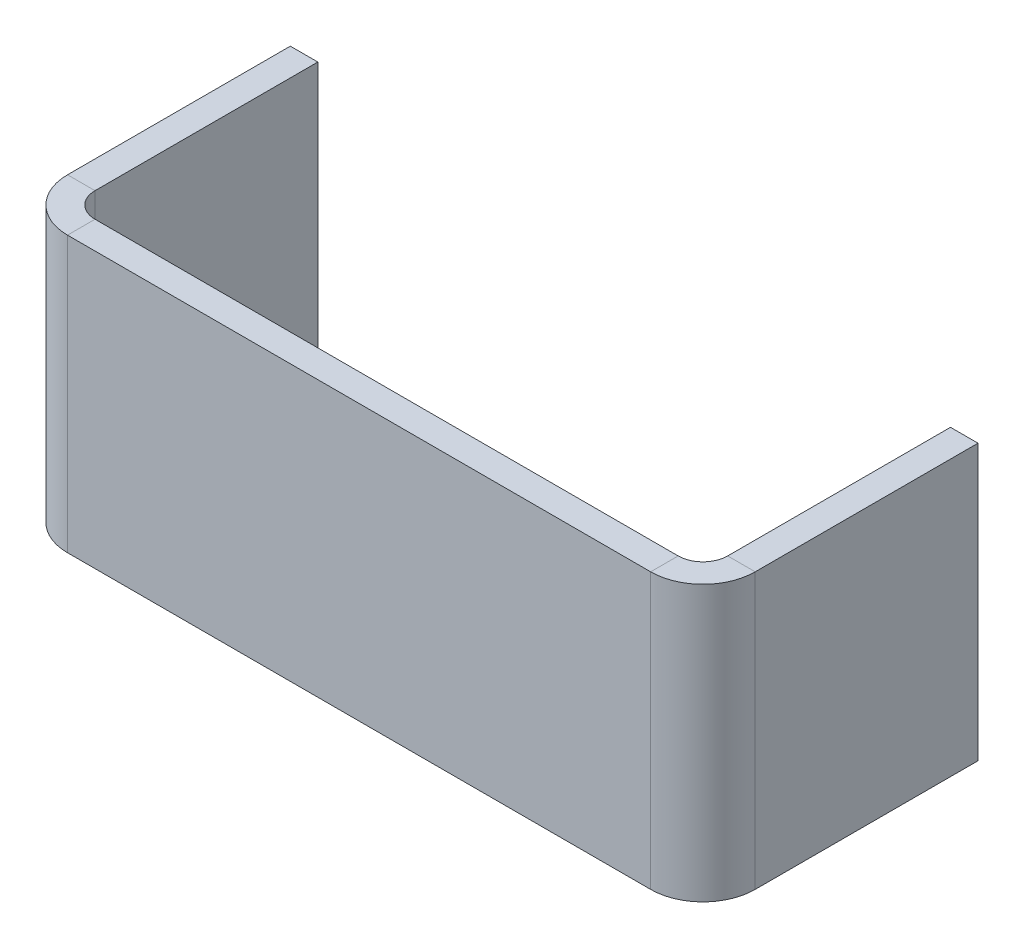
ISO-10303-21;
HEADER;
FILE_DESCRIPTION(('STEP AP214'),'2;1');
FILE_NAME('part.step','',(''),(''),'','','');
FILE_SCHEMA(('AUTOMOTIVE_DESIGN { 1 0 10303 214 1 1 1 1 }'));
ENDSEC;
DATA;
#1=APPLICATION_CONTEXT('core data for automotive mechanical design processes');
#2=APPLICATION_PROTOCOL_DEFINITION('international standard','automotive_design',2000,#1);
#3=PRODUCT_CONTEXT('',#1,'mechanical');
#4=PRODUCT('Part','Part','',(#3));
#5=PRODUCT_RELATED_PRODUCT_CATEGORY('part','',(#4));
#6=PRODUCT_DEFINITION_FORMATION('','',#4);
#7=PRODUCT_DEFINITION_CONTEXT('part definition',#1,'design');
#8=PRODUCT_DEFINITION('design','',#6,#7);
#9=PRODUCT_DEFINITION_SHAPE('','',#8);
#10=(LENGTH_UNIT() NAMED_UNIT(*) SI_UNIT(.MILLI.,.METRE.));
#11=(NAMED_UNIT(*) PLANE_ANGLE_UNIT() SI_UNIT($,.RADIAN.));
#12=(NAMED_UNIT(*) SI_UNIT($,.STERADIAN.) SOLID_ANGLE_UNIT());
#13=UNCERTAINTY_MEASURE_WITH_UNIT(LENGTH_MEASURE(1.E-05),#10,'distance_accuracy_value','');
#14=(GEOMETRIC_REPRESENTATION_CONTEXT(3) GLOBAL_UNCERTAINTY_ASSIGNED_CONTEXT((#13)) GLOBAL_UNIT_ASSIGNED_CONTEXT((#10,
#11,#12)) REPRESENTATION_CONTEXT('',''));
#15=CARTESIAN_POINT('',(0.,0.,0.));
#16=DIRECTION('',(0.,0.,1.));
#17=DIRECTION('',(1.,0.,0.));
#18=AXIS2_PLACEMENT_3D('',#15,#16,#17);
#19=CARTESIAN_POINT('',(0.,0.,-2.));
#20=DIRECTION('',(0.,0.,-1.));
#21=DIRECTION('',(-1.,0.,0.));
#22=AXIS2_PLACEMENT_3D('',#19,#20,#21);
#23=PLANE('',#22);
#24=DIRECTION('',(-1.,0.,0.));
#25=VECTOR('',#24,1.);
#26=CARTESIAN_POINT('',(-0.853018372703414,20.,-2.));
#27=LINE('',#26,#25);
#28=CARTESIAN_POINT('',(45.3469816272966,20.,-2.));
#29=VERTEX_POINT('',#28);
#30=CARTESIAN_POINT('',(2.94698162729658,20.,-2.));
#31=VERTEX_POINT('',#30);
#32=EDGE_CURVE('E13',#29,#31,#27,.T.);
#33=ORIENTED_EDGE('',*,*,#32,.F.);
#34=DIRECTION('',(0.,-1.,0.));
#35=VECTOR('',#34,1.);
#36=CARTESIAN_POINT('',(45.3469816272966,0.,-2.));
#37=LINE('',#36,#35);
#38=CARTESIAN_POINT('',(45.3469816272966,0.,-2.));
#39=VERTEX_POINT('',#38);
#40=EDGE_CURVE('E243',#39,#29,#37,.F.);
#41=ORIENTED_EDGE('',*,*,#40,.F.);
#42=DIRECTION('',(1.,0.,0.));
#43=VECTOR('',#42,1.);
#44=CARTESIAN_POINT('',(-0.853018372703415,0.,-2.));
#45=LINE('',#44,#43);
#46=CARTESIAN_POINT('',(2.94698162729658,0.,-2.));
#47=VERTEX_POINT('',#46);
#48=EDGE_CURVE('E90',#47,#39,#45,.T.);
#49=ORIENTED_EDGE('',*,*,#48,.F.);
#50=DIRECTION('',(0.,1.,0.));
#51=VECTOR('',#50,1.);
#52=CARTESIAN_POINT('',(2.94698162729658,20.,-2.));
#53=LINE('',#52,#51);
#54=EDGE_CURVE('E318',#31,#47,#53,.F.);
#55=ORIENTED_EDGE('',*,*,#54,.F.);
#56=EDGE_LOOP('',(#33,#41,#49,#55));
#57=FACE_BOUND('',#56,.T.);
#58=ADVANCED_FACE('F80',(#57),#23,.T.);
#59=CARTESIAN_POINT('',(0.,0.,0.));
#60=DIRECTION('',(0.,0.,-1.));
#61=DIRECTION('',(-1.,0.,0.));
#62=AXIS2_PLACEMENT_3D('',#59,#60,#61);
#63=PLANE('',#62);
#64=DIRECTION('',(0.,-1.,0.));
#65=VECTOR('',#64,1.);
#66=CARTESIAN_POINT('',(45.3469816272966,0.,0.));
#67=LINE('',#66,#65);
#68=CARTESIAN_POINT('',(45.3469816272966,0.,0.));
#69=VERTEX_POINT('',#68);
#70=CARTESIAN_POINT('',(45.3469816272966,20.,0.));
#71=VERTEX_POINT('',#70);
#72=EDGE_CURVE('E227',#69,#71,#67,.F.);
#73=ORIENTED_EDGE('',*,*,#72,.T.);
#74=DIRECTION('',(-1.,0.,0.));
#75=VECTOR('',#74,1.);
#76=CARTESIAN_POINT('',(-0.853018372703414,20.,0.));
#77=LINE('',#76,#75);
#78=CARTESIAN_POINT('',(2.94698162729658,20.,0.));
#79=VERTEX_POINT('',#78);
#80=EDGE_CURVE('E84',#71,#79,#77,.T.);
#81=ORIENTED_EDGE('',*,*,#80,.T.);
#82=DIRECTION('',(0.,1.,0.));
#83=VECTOR('',#82,1.);
#84=CARTESIAN_POINT('',(2.94698162729658,20.,0.));
#85=LINE('',#84,#83);
#86=CARTESIAN_POINT('',(2.94698162729658,0.,0.));
#87=VERTEX_POINT('',#86);
#88=EDGE_CURVE('E302',#79,#87,#85,.F.);
#89=ORIENTED_EDGE('',*,*,#88,.T.);
#90=DIRECTION('',(1.,0.,0.));
#91=VECTOR('',#90,1.);
#92=CARTESIAN_POINT('',(-0.853018372703415,0.,0.));
#93=LINE('',#92,#91);
#94=EDGE_CURVE('E327',#87,#69,#93,.T.);
#95=ORIENTED_EDGE('',*,*,#94,.T.);
#96=EDGE_LOOP('',(#73,#81,#89,#95));
#97=FACE_BOUND('',#96,.T.);
#98=ADVANCED_FACE('F337',(#97),#63,.F.);
#99=CARTESIAN_POINT('',(-0.853018372703415,0.,-2.));
#100=DIRECTION('',(0.,-1.,0.));
#101=DIRECTION('',(0.,0.,-1.));
#102=AXIS2_PLACEMENT_3D('',#99,#100,#101);
#103=PLANE('',#102);
#104=ORIENTED_EDGE('',*,*,#48,.T.);
#105=DIRECTION('',(0.,0.,1.));
#106=VECTOR('',#105,1.);
#107=CARTESIAN_POINT('',(45.3469816272966,0.,-2.));
#108=LINE('',#107,#106);
#109=EDGE_CURVE('E235',#39,#69,#108,.T.);
#110=ORIENTED_EDGE('',*,*,#109,.T.);
#111=ORIENTED_EDGE('',*,*,#94,.F.);
#112=DIRECTION('',(0.,0.,1.));
#113=VECTOR('',#112,1.);
#114=CARTESIAN_POINT('',(2.94698162729658,0.,-2.));
#115=LINE('',#114,#113);
#116=EDGE_CURVE('E98',#47,#87,#115,.T.);
#117=ORIENTED_EDGE('',*,*,#116,.F.);
#118=EDGE_LOOP('',(#104,#110,#111,#117));
#119=FACE_BOUND('',#118,.T.);
#120=ADVANCED_FACE('F82',(#119),#103,.T.);
#121=CARTESIAN_POINT('',(-0.853018372703414,20.,-2.));
#122=DIRECTION('',(0.,1.,0.));
#123=DIRECTION('',(0.,0.,1.));
#124=AXIS2_PLACEMENT_3D('',#121,#122,#123);
#125=PLANE('',#124);
#126=DIRECTION('',(0.,0.,1.));
#127=VECTOR('',#126,1.);
#128=CARTESIAN_POINT('',(45.3469816272966,20.,-2.));
#129=LINE('',#128,#127);
#130=EDGE_CURVE('E250',#29,#71,#129,.T.);
#131=ORIENTED_EDGE('',*,*,#130,.F.);
#132=ORIENTED_EDGE('',*,*,#32,.T.);
#133=DIRECTION('',(0.,0.,1.));
#134=VECTOR('',#133,1.);
#135=CARTESIAN_POINT('',(2.94698162729658,20.,-2.));
#136=LINE('',#135,#134);
#137=EDGE_CURVE('E310',#31,#79,#136,.T.);
#138=ORIENTED_EDGE('',*,*,#137,.T.);
#139=ORIENTED_EDGE('',*,*,#80,.F.);
#140=EDGE_LOOP('',(#131,#132,#138,#139));
#141=FACE_BOUND('',#140,.T.);
#142=ADVANCED_FACE('F389',(#141),#125,.T.);
#143=CARTESIAN_POINT('',(2.94698162729658,0.,-3.8));
#144=DIRECTION('',(0.,-1.,0.));
#145=DIRECTION('',(0.,0.,-1.));
#146=AXIS2_PLACEMENT_3D('',#143,#144,#145);
#147=PLANE('',#146);
#148=DIRECTION('',(-1.,0.,0.));
#149=VECTOR('',#148,1.);
#150=CARTESIAN_POINT('',(-0.853018372703423,0.,-3.79999999999999));
#151=LINE('',#150,#149);
#152=CARTESIAN_POINT('',(1.14698162729658,0.,-3.79999999999999));
#153=VERTEX_POINT('',#152);
#154=CARTESIAN_POINT('',(-0.853018372703421,0.,-3.79999999999999));
#155=VERTEX_POINT('',#154);
#156=EDGE_CURVE('E254',#153,#155,#151,.T.);
#157=ORIENTED_EDGE('',*,*,#156,.F.);
#158=CARTESIAN_POINT('',(2.94698162729658,0.,-3.8));
#159=DIRECTION('',(0.,1.,0.));
#160=DIRECTION('',(0.,0.,1.));
#161=AXIS2_PLACEMENT_3D('',#158,#159,#160);
#162=CIRCLE('',#161,1.8);
#163=EDGE_CURVE('E314',#47,#153,#162,.F.);
#164=ORIENTED_EDGE('',*,*,#163,.F.);
#165=ORIENTED_EDGE('',*,*,#116,.T.);
#166=CARTESIAN_POINT('',(2.94698162729658,0.,-3.8));
#167=DIRECTION('',(0.,1.,0.));
#168=DIRECTION('',(0.,0.,1.));
#169=AXIS2_PLACEMENT_3D('',#166,#167,#168);
#170=CIRCLE('',#169,3.8);
#171=EDGE_CURVE('E305',#87,#155,#170,.F.);
#172=ORIENTED_EDGE('',*,*,#171,.T.);
#173=EDGE_LOOP('',(#157,#164,#165,#172));
#174=FACE_BOUND('',#173,.T.);
#175=ADVANCED_FACE('F364',(#174),#147,.T.);
#176=CARTESIAN_POINT('',(2.94698162729658,20.,-3.8));
#177=DIRECTION('',(0.,-1.,0.));
#178=DIRECTION('',(0.,0.,-1.));
#179=AXIS2_PLACEMENT_3D('',#176,#177,#178);
#180=PLANE('',#179);
#181=CARTESIAN_POINT('',(2.94698162729658,20.,-3.8));
#182=DIRECTION('',(0.,1.,0.));
#183=DIRECTION('',(0.,0.,1.));
#184=AXIS2_PLACEMENT_3D('',#181,#182,#183);
#185=CIRCLE('',#184,1.8);
#186=CARTESIAN_POINT('',(1.14698162729658,20.,-3.79999999999999));
#187=VERTEX_POINT('',#186);
#188=EDGE_CURVE('E261',#187,#31,#185,.T.);
#189=ORIENTED_EDGE('',*,*,#188,.F.);
#190=DIRECTION('',(-1.,0.,0.));
#191=VECTOR('',#190,1.);
#192=CARTESIAN_POINT('',(1.14698162729658,20.,-3.79999999999999));
#193=LINE('',#192,#191);
#194=CARTESIAN_POINT('',(-0.85301837270342,20.,-3.79999999999999));
#195=VERTEX_POINT('',#194);
#196=EDGE_CURVE('E292',#187,#195,#193,.T.);
#197=ORIENTED_EDGE('',*,*,#196,.T.);
#198=CARTESIAN_POINT('',(2.94698162729658,20.,-3.8));
#199=DIRECTION('',(0.,1.,0.));
#200=DIRECTION('',(0.,0.,1.));
#201=AXIS2_PLACEMENT_3D('',#198,#199,#200);
#202=CIRCLE('',#201,3.8);
#203=EDGE_CURVE('E306',#195,#79,#202,.T.);
#204=ORIENTED_EDGE('',*,*,#203,.T.);
#205=ORIENTED_EDGE('',*,*,#137,.F.);
#206=EDGE_LOOP('',(#189,#197,#204,#205));
#207=FACE_BOUND('',#206,.T.);
#208=ADVANCED_FACE('F345',(#207),#180,.F.);
#209=CARTESIAN_POINT('',(2.94698162729658,20.,-3.8));
#210=DIRECTION('',(0.,1.,0.));
#211=DIRECTION('',(-1.,0.,0.));
#212=AXIS2_PLACEMENT_3D('',#209,#210,#211);
#213=CYLINDRICAL_SURFACE('',#212,3.8);
#214=ORIENTED_EDGE('',*,*,#88,.F.);
#215=ORIENTED_EDGE('',*,*,#203,.F.);
#216=DIRECTION('',(0.,1.,0.));
#217=VECTOR('',#216,1.);
#218=CARTESIAN_POINT('',(-0.853018372703421,0.,-3.79999999999999));
#219=LINE('',#218,#217);
#220=EDGE_CURVE('E288',#155,#195,#219,.T.);
#221=ORIENTED_EDGE('',*,*,#220,.F.);
#222=ORIENTED_EDGE('',*,*,#171,.F.);
#223=EDGE_LOOP('',(#214,#215,#221,#222));
#224=FACE_BOUND('',#223,.T.);
#225=ADVANCED_FACE('F341',(#224),#213,.T.);
#226=CARTESIAN_POINT('',(2.94698162729658,20.,-3.8));
#227=DIRECTION('',(0.,1.,0.));
#228=DIRECTION('',(-1.,0.,0.));
#229=AXIS2_PLACEMENT_3D('',#226,#227,#228);
#230=CYLINDRICAL_SURFACE('',#229,1.8);
#231=ORIENTED_EDGE('',*,*,#54,.T.);
#232=ORIENTED_EDGE('',*,*,#163,.T.);
#233=DIRECTION('',(0.,-1.,0.));
#234=VECTOR('',#233,1.);
#235=CARTESIAN_POINT('',(1.14698162729658,0.,-3.79999999999999));
#236=LINE('',#235,#234);
#237=EDGE_CURVE('E296',#153,#187,#236,.F.);
#238=ORIENTED_EDGE('',*,*,#237,.T.);
#239=ORIENTED_EDGE('',*,*,#188,.T.);
#240=EDGE_LOOP('',(#231,#232,#238,#239));
#241=FACE_BOUND('',#240,.T.);
#242=ADVANCED_FACE('F367',(#241),#230,.F.);
#243=CARTESIAN_POINT('',(-0.853018372703414,20.,-1.99999999999999));
#244=DIRECTION('',(0.,1.,0.));
#245=DIRECTION('',(-1.,0.,0.));
#246=AXIS2_PLACEMENT_3D('',#243,#244,#245);
#247=PLANE('',#246);
#248=DIRECTION('',(0.,0.,1.));
#249=VECTOR('',#248,1.);
#250=CARTESIAN_POINT('',(-0.853018372703414,20.,-1.99999999999999));
#251=LINE('',#250,#249);
#252=CARTESIAN_POINT('',(-0.853018372703477,20.,-20.));
#253=VERTEX_POINT('',#252);
#254=EDGE_CURVE('E266',#253,#195,#251,.T.);
#255=ORIENTED_EDGE('',*,*,#254,.T.);
#256=ORIENTED_EDGE('',*,*,#196,.F.);
#257=DIRECTION('',(0.,0.,-1.));
#258=VECTOR('',#257,1.);
#259=CARTESIAN_POINT('',(1.14698162729659,20.,0.));
#260=LINE('',#259,#258);
#261=CARTESIAN_POINT('',(1.14698162729652,20.,-20.));
#262=VERTEX_POINT('',#261);
#263=EDGE_CURVE('E277',#262,#187,#260,.F.);
#264=ORIENTED_EDGE('',*,*,#263,.F.);
#265=DIRECTION('',(1.,0.,0.));
#266=VECTOR('',#265,1.);
#267=CARTESIAN_POINT('',(-0.853018372703477,20.,-20.));
#268=LINE('',#267,#266);
#269=EDGE_CURVE('E258',#253,#262,#268,.T.);
#270=ORIENTED_EDGE('',*,*,#269,.F.);
#271=EDGE_LOOP('',(#255,#256,#264,#270));
#272=FACE_BOUND('',#271,.T.);
#273=ADVANCED_FACE('F354',(#272),#247,.T.);
#274=CARTESIAN_POINT('',(-0.853018372703478,0.,-20.));
#275=DIRECTION('',(0.,-1.,0.));
#276=DIRECTION('',(1.,0.,0.));
#277=AXIS2_PLACEMENT_3D('',#274,#275,#276);
#278=PLANE('',#277);
#279=DIRECTION('',(0.,0.,1.));
#280=VECTOR('',#279,1.);
#281=CARTESIAN_POINT('',(1.14698162729659,0.,0.));
#282=LINE('',#281,#280);
#283=CARTESIAN_POINT('',(1.14698162729652,0.,-20.));
#284=VERTEX_POINT('',#283);
#285=EDGE_CURVE('E285',#153,#284,#282,.F.);
#286=ORIENTED_EDGE('',*,*,#285,.F.);
#287=ORIENTED_EDGE('',*,*,#156,.T.);
#288=DIRECTION('',(0.,0.,-1.));
#289=VECTOR('',#288,1.);
#290=CARTESIAN_POINT('',(-0.853018372703478,0.,-20.));
#291=LINE('',#290,#289);
#292=CARTESIAN_POINT('',(-0.853018372703478,0.,-20.));
#293=VERTEX_POINT('',#292);
#294=EDGE_CURVE('E274',#155,#293,#291,.T.);
#295=ORIENTED_EDGE('',*,*,#294,.T.);
#296=DIRECTION('',(1.,0.,0.));
#297=VECTOR('',#296,1.);
#298=CARTESIAN_POINT('',(-0.853018372703478,0.,-20.));
#299=LINE('',#298,#297);
#300=EDGE_CURVE('E262',#293,#284,#299,.T.);
#301=ORIENTED_EDGE('',*,*,#300,.T.);
#302=EDGE_LOOP('',(#286,#287,#295,#301));
#303=FACE_BOUND('',#302,.T.);
#304=ADVANCED_FACE('F361',(#303),#278,.T.);
#305=CARTESIAN_POINT('',(-0.853018372703408,0.,0.));
#306=DIRECTION('',(-1.,0.,0.));
#307=DIRECTION('',(0.,0.,1.));
#308=AXIS2_PLACEMENT_3D('',#305,#306,#307);
#309=PLANE('',#308);
#310=ORIENTED_EDGE('',*,*,#294,.F.);
#311=ORIENTED_EDGE('',*,*,#220,.T.);
#312=ORIENTED_EDGE('',*,*,#254,.F.);
#313=DIRECTION('',(0.,1.,0.));
#314=VECTOR('',#313,1.);
#315=CARTESIAN_POINT('',(-0.853018372703477,20.,-20.));
#316=LINE('',#315,#314);
#317=EDGE_CURVE('E270',#293,#253,#316,.T.);
#318=ORIENTED_EDGE('',*,*,#317,.F.);
#319=EDGE_LOOP('',(#310,#311,#312,#318));
#320=FACE_BOUND('',#319,.T.);
#321=ADVANCED_FACE('F352',(#320),#309,.T.);
#322=CARTESIAN_POINT('',(1.14698162729659,0.,0.));
#323=DIRECTION('',(-1.,0.,0.));
#324=DIRECTION('',(0.,0.,1.));
#325=AXIS2_PLACEMENT_3D('',#322,#323,#324);
#326=PLANE('',#325);
#327=ORIENTED_EDGE('',*,*,#237,.F.);
#328=ORIENTED_EDGE('',*,*,#285,.T.);
#329=DIRECTION('',(0.,-1.,0.));
#330=VECTOR('',#329,1.);
#331=CARTESIAN_POINT('',(1.14698162729652,0.,-20.));
#332=LINE('',#331,#330);
#333=EDGE_CURVE('E281',#284,#262,#332,.F.);
#334=ORIENTED_EDGE('',*,*,#333,.T.);
#335=ORIENTED_EDGE('',*,*,#263,.T.);
#336=EDGE_LOOP('',(#327,#328,#334,#335));
#337=FACE_BOUND('',#336,.T.);
#338=ADVANCED_FACE('F369',(#337),#326,.F.);
#339=CARTESIAN_POINT('',(-0.853018372703477,20.,-20.));
#340=DIRECTION('',(0.,0.,-1.));
#341=DIRECTION('',(-1.,0.,0.));
#342=AXIS2_PLACEMENT_3D('',#339,#340,#341);
#343=PLANE('',#342);
#344=ORIENTED_EDGE('',*,*,#333,.F.);
#345=ORIENTED_EDGE('',*,*,#300,.F.);
#346=ORIENTED_EDGE('',*,*,#317,.T.);
#347=ORIENTED_EDGE('',*,*,#269,.T.);
#348=EDGE_LOOP('',(#344,#345,#346,#347));
#349=FACE_BOUND('',#348,.T.);
#350=ADVANCED_FACE('F358',(#349),#343,.T.);
#351=CARTESIAN_POINT('',(45.3469816272966,20.,-3.8));
#352=DIRECTION('',(0.,1.,0.));
#353=DIRECTION('',(0.,0.,1.));
#354=AXIS2_PLACEMENT_3D('',#351,#352,#353);
#355=PLANE('',#354);
#356=DIRECTION('',(1.,0.,0.));
#357=VECTOR('',#356,1.);
#358=CARTESIAN_POINT('',(49.1469816272966,20.,-3.79999999999999));
#359=LINE('',#358,#357);
#360=CARTESIAN_POINT('',(47.1469816272966,20.,-3.8));
#361=VERTEX_POINT('',#360);
#362=CARTESIAN_POINT('',(49.1469816272966,20.,-3.79999999999999));
#363=VERTEX_POINT('',#362);
#364=EDGE_CURVE('E223',#361,#363,#359,.T.);
#365=ORIENTED_EDGE('',*,*,#364,.F.);
#366=CARTESIAN_POINT('',(45.3469816272966,20.,-3.8));
#367=DIRECTION('',(0.,-1.,0.));
#368=DIRECTION('',(0.,0.,-1.));
#369=AXIS2_PLACEMENT_3D('',#366,#367,#368);
#370=CIRCLE('',#369,1.8);
#371=EDGE_CURVE('E239',#29,#361,#370,.F.);
#372=ORIENTED_EDGE('',*,*,#371,.F.);
#373=ORIENTED_EDGE('',*,*,#130,.T.);
#374=CARTESIAN_POINT('',(45.3469816272966,20.,-3.8));
#375=DIRECTION('',(0.,-1.,0.));
#376=DIRECTION('',(0.,0.,-1.));
#377=AXIS2_PLACEMENT_3D('',#374,#375,#376);
#378=CIRCLE('',#377,3.8);
#379=EDGE_CURVE('E230',#71,#363,#378,.F.);
#380=ORIENTED_EDGE('',*,*,#379,.T.);
#381=EDGE_LOOP('',(#365,#372,#373,#380));
#382=FACE_BOUND('',#381,.T.);
#383=ADVANCED_FACE('F376',(#382),#355,.T.);
#384=CARTESIAN_POINT('',(45.3469816272966,0.,-3.8));
#385=DIRECTION('',(0.,1.,0.));
#386=DIRECTION('',(0.,0.,1.));
#387=AXIS2_PLACEMENT_3D('',#384,#385,#386);
#388=PLANE('',#387);
#389=CARTESIAN_POINT('',(45.3469816272966,0.,-3.8));
#390=DIRECTION('',(0.,-1.,0.));
#391=DIRECTION('',(0.,0.,-1.));
#392=AXIS2_PLACEMENT_3D('',#389,#390,#391);
#393=CIRCLE('',#392,1.8);
#394=CARTESIAN_POINT('',(47.1469816272966,0.,-3.8));
#395=VERTEX_POINT('',#394);
#396=EDGE_CURVE('E184',#395,#39,#393,.T.);
#397=ORIENTED_EDGE('',*,*,#396,.F.);
#398=DIRECTION('',(1.,0.,0.));
#399=VECTOR('',#398,1.);
#400=CARTESIAN_POINT('',(47.1469816272966,0.,-3.8));
#401=LINE('',#400,#399);
#402=CARTESIAN_POINT('',(49.1469816272966,0.,-3.79999999999999));
#403=VERTEX_POINT('',#402);
#404=EDGE_CURVE('E216',#395,#403,#401,.T.);
#405=ORIENTED_EDGE('',*,*,#404,.T.);
#406=CARTESIAN_POINT('',(45.3469816272966,0.,-3.8));
#407=DIRECTION('',(0.,-1.,0.));
#408=DIRECTION('',(0.,0.,-1.));
#409=AXIS2_PLACEMENT_3D('',#406,#407,#408);
#410=CIRCLE('',#409,3.8);
#411=EDGE_CURVE('E231',#403,#69,#410,.T.);
#412=ORIENTED_EDGE('',*,*,#411,.T.);
#413=ORIENTED_EDGE('',*,*,#109,.F.);
#414=EDGE_LOOP('',(#397,#405,#412,#413));
#415=FACE_BOUND('',#414,.T.);
#416=ADVANCED_FACE('F409',(#415),#388,.F.);
#417=CARTESIAN_POINT('',(45.3469816272966,0.,-3.8));
#418=DIRECTION('',(0.,-1.,0.));
#419=DIRECTION('',(1.,0.,0.));
#420=AXIS2_PLACEMENT_3D('',#417,#418,#419);
#421=CYLINDRICAL_SURFACE('',#420,3.8);
#422=ORIENTED_EDGE('',*,*,#72,.F.);
#423=ORIENTED_EDGE('',*,*,#411,.F.);
#424=DIRECTION('',(0.,-1.,0.));
#425=VECTOR('',#424,1.);
#426=CARTESIAN_POINT('',(49.1469816272966,20.,-3.79999999999999));
#427=LINE('',#426,#425);
#428=EDGE_CURVE('E193',#403,#363,#427,.F.);
#429=ORIENTED_EDGE('',*,*,#428,.T.);
#430=ORIENTED_EDGE('',*,*,#379,.F.);
#431=EDGE_LOOP('',(#422,#423,#429,#430));
#432=FACE_BOUND('',#431,.T.);
#433=ADVANCED_FACE('F411',(#432),#421,.T.);
#434=CARTESIAN_POINT('',(45.3469816272966,0.,-3.8));
#435=DIRECTION('',(0.,-1.,0.));
#436=DIRECTION('',(1.,0.,0.));
#437=AXIS2_PLACEMENT_3D('',#434,#435,#436);
#438=CYLINDRICAL_SURFACE('',#437,1.8);
#439=ORIENTED_EDGE('',*,*,#40,.T.);
#440=ORIENTED_EDGE('',*,*,#371,.T.);
#441=DIRECTION('',(0.,-1.,0.));
#442=VECTOR('',#441,1.);
#443=CARTESIAN_POINT('',(47.1469816272966,20.,-3.8));
#444=LINE('',#443,#442);
#445=EDGE_CURVE('E220',#361,#395,#444,.T.);
#446=ORIENTED_EDGE('',*,*,#445,.T.);
#447=ORIENTED_EDGE('',*,*,#396,.T.);
#448=EDGE_LOOP('',(#439,#440,#446,#447));
#449=FACE_BOUND('',#448,.T.);
#450=ADVANCED_FACE('F399',(#449),#438,.F.);
#451=CARTESIAN_POINT('',(49.1469816272966,20.,-1.99999999999999));
#452=DIRECTION('',(0.,1.,0.));
#453=DIRECTION('',(0.,0.,1.));
#454=AXIS2_PLACEMENT_3D('',#451,#452,#453);
#455=PLANE('',#454);
#456=DIRECTION('',(0.,0.,-1.));
#457=VECTOR('',#456,1.);
#458=CARTESIAN_POINT('',(47.1469816272966,20.,1.70512845604544E-13));
#459=LINE('',#458,#457);
#460=CARTESIAN_POINT('',(47.1469816272966,20.,-20.));
#461=VERTEX_POINT('',#460);
#462=EDGE_CURVE('E211',#361,#461,#459,.T.);
#463=ORIENTED_EDGE('',*,*,#462,.F.);
#464=ORIENTED_EDGE('',*,*,#364,.T.);
#465=DIRECTION('',(0.,0.,1.));
#466=VECTOR('',#465,1.);
#467=CARTESIAN_POINT('',(49.1469816272966,20.,-1.99999999999999));
#468=LINE('',#467,#466);
#469=CARTESIAN_POINT('',(49.1469816272967,20.,-20.));
#470=VERTEX_POINT('',#469);
#471=EDGE_CURVE('E200',#363,#470,#468,.F.);
#472=ORIENTED_EDGE('',*,*,#471,.T.);
#473=DIRECTION('',(-1.,0.,0.));
#474=VECTOR('',#473,1.);
#475=CARTESIAN_POINT('',(49.1469816272967,20.,-20.));
#476=LINE('',#475,#474);
#477=EDGE_CURVE('E185',#470,#461,#476,.T.);
#478=ORIENTED_EDGE('',*,*,#477,.T.);
#479=EDGE_LOOP('',(#463,#464,#472,#478));
#480=FACE_BOUND('',#479,.T.);
#481=ADVANCED_FACE('F404',(#480),#455,.T.);
#482=CARTESIAN_POINT('',(49.1469816272967,0.,-20.));
#483=DIRECTION('',(0.,-1.,0.));
#484=DIRECTION('',(0.,0.,-1.));
#485=AXIS2_PLACEMENT_3D('',#482,#483,#484);
#486=PLANE('',#485);
#487=DIRECTION('',(0.,0.,-1.));
#488=VECTOR('',#487,1.);
#489=CARTESIAN_POINT('',(49.1469816272967,0.,-20.));
#490=LINE('',#489,#488);
#491=CARTESIAN_POINT('',(49.1469816272967,0.,-20.));
#492=VERTEX_POINT('',#491);
#493=EDGE_CURVE('E176',#492,#403,#490,.F.);
#494=ORIENTED_EDGE('',*,*,#493,.T.);
#495=ORIENTED_EDGE('',*,*,#404,.F.);
#496=DIRECTION('',(0.,0.,1.));
#497=VECTOR('',#496,1.);
#498=CARTESIAN_POINT('',(47.1469816272966,0.,1.70512845604544E-13));
#499=LINE('',#498,#497);
#500=CARTESIAN_POINT('',(47.1469816272966,0.,-20.));
#501=VERTEX_POINT('',#500);
#502=EDGE_CURVE('E178',#501,#395,#499,.T.);
#503=ORIENTED_EDGE('',*,*,#502,.F.);
#504=DIRECTION('',(-1.,0.,0.));
#505=VECTOR('',#504,1.);
#506=CARTESIAN_POINT('',(49.1469816272967,0.,-20.));
#507=LINE('',#506,#505);
#508=EDGE_CURVE('E172',#492,#501,#507,.T.);
#509=ORIENTED_EDGE('',*,*,#508,.F.);
#510=EDGE_LOOP('',(#494,#495,#503,#509));
#511=FACE_BOUND('',#510,.T.);
#512=ADVANCED_FACE('F174',(#511),#486,.T.);
#513=CARTESIAN_POINT('',(49.1469816272966,0.,1.77495808282231E-13));
#514=DIRECTION('',(-1.,0.,0.));
#515=DIRECTION('',(0.,0.,1.));
#516=AXIS2_PLACEMENT_3D('',#513,#514,#515);
#517=PLANE('',#516);
#518=ORIENTED_EDGE('',*,*,#428,.F.);
#519=ORIENTED_EDGE('',*,*,#493,.F.);
#520=DIRECTION('',(0.,1.,0.));
#521=VECTOR('',#520,1.);
#522=CARTESIAN_POINT('',(49.1469816272967,20.,-20.));
#523=LINE('',#522,#521);
#524=EDGE_CURVE('E192',#470,#492,#523,.F.);
#525=ORIENTED_EDGE('',*,*,#524,.F.);
#526=ORIENTED_EDGE('',*,*,#471,.F.);
#527=EDGE_LOOP('',(#518,#519,#525,#526));
#528=FACE_BOUND('',#527,.T.);
#529=ADVANCED_FACE('F190',(#528),#517,.F.);
#530=CARTESIAN_POINT('',(47.1469816272966,0.,1.70512845604544E-13));
#531=DIRECTION('',(-1.,0.,0.));
#532=DIRECTION('',(0.,0.,1.));
#533=AXIS2_PLACEMENT_3D('',#530,#531,#532);
#534=PLANE('',#533);
#535=ORIENTED_EDGE('',*,*,#502,.T.);
#536=ORIENTED_EDGE('',*,*,#445,.F.);
#537=ORIENTED_EDGE('',*,*,#462,.T.);
#538=DIRECTION('',(0.,-1.,0.));
#539=VECTOR('',#538,1.);
#540=CARTESIAN_POINT('',(47.1469816272966,0.,-20.));
#541=LINE('',#540,#539);
#542=EDGE_CURVE('E208',#461,#501,#541,.T.);
#543=ORIENTED_EDGE('',*,*,#542,.T.);
#544=EDGE_LOOP('',(#535,#536,#537,#543));
#545=FACE_BOUND('',#544,.T.);
#546=ADVANCED_FACE('F406',(#545),#534,.T.);
#547=CARTESIAN_POINT('',(49.1469816272967,20.,-20.));
#548=DIRECTION('',(0.,0.,-1.));
#549=DIRECTION('',(-1.,0.,0.));
#550=AXIS2_PLACEMENT_3D('',#547,#548,#549);
#551=PLANE('',#550);
#552=ORIENTED_EDGE('',*,*,#542,.F.);
#553=ORIENTED_EDGE('',*,*,#477,.F.);
#554=ORIENTED_EDGE('',*,*,#524,.T.);
#555=ORIENTED_EDGE('',*,*,#508,.T.);
#556=EDGE_LOOP('',(#552,#553,#554,#555));
#557=FACE_BOUND('',#556,.T.);
#558=ADVANCED_FACE('F197',(#557),#551,.T.);
#559=CLOSED_SHELL('',(#58,#98,#120,#142,#175,#208,#225,#242,#273,#304,#321,#338,#350,#383,#416,
#433,#450,#481,#512,#529,#546,#558));
#560=MANIFOLD_SOLID_BREP('B2',#559);
#561=ADVANCED_BREP_SHAPE_REPRESENTATION('',(#18,#560),#14);
#562=SHAPE_DEFINITION_REPRESENTATION(#9,#561);
ENDSEC;
END-ISO-10303-21;
